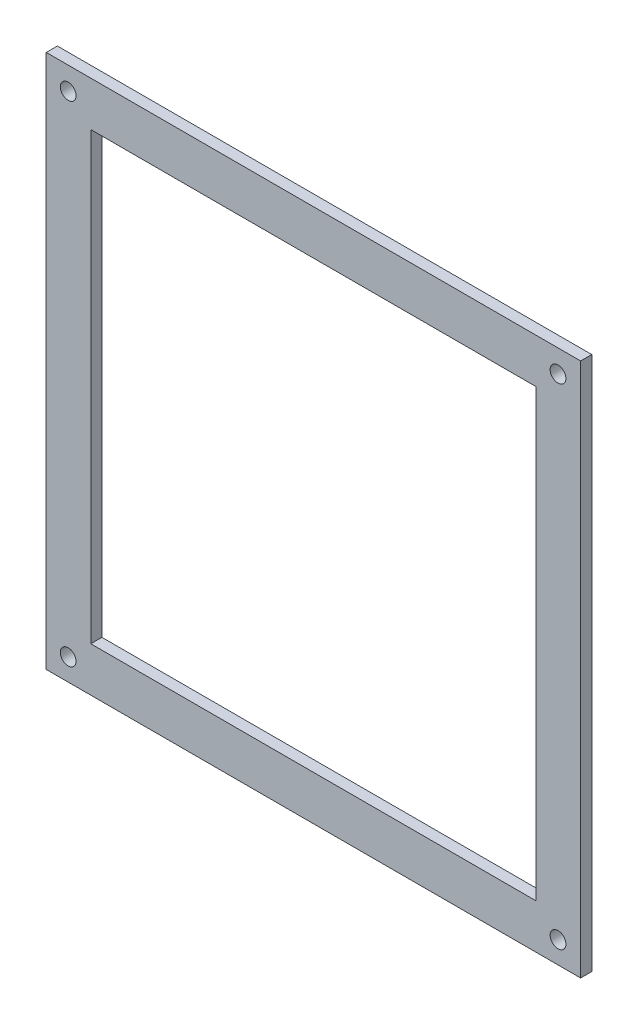
ISO-10303-21;
HEADER;
FILE_DESCRIPTION(('STEP AP214'),'2;1');
FILE_NAME('part.step','',(''),(''),'','','');
FILE_SCHEMA(('AUTOMOTIVE_DESIGN { 1 0 10303 214 1 1 1 1 }'));
ENDSEC;
DATA;
#1=APPLICATION_CONTEXT('core data for automotive mechanical design processes');
#2=APPLICATION_PROTOCOL_DEFINITION('international standard','automotive_design',2000,#1);
#3=PRODUCT_CONTEXT('',#1,'mechanical');
#4=PRODUCT('Part','Part','',(#3));
#5=PRODUCT_RELATED_PRODUCT_CATEGORY('part','',(#4));
#6=PRODUCT_DEFINITION_FORMATION('','',#4);
#7=PRODUCT_DEFINITION_CONTEXT('part definition',#1,'design');
#8=PRODUCT_DEFINITION('design','',#6,#7);
#9=PRODUCT_DEFINITION_SHAPE('','',#8);
#10=(LENGTH_UNIT() NAMED_UNIT(*) SI_UNIT(.MILLI.,.METRE.));
#11=(NAMED_UNIT(*) PLANE_ANGLE_UNIT() SI_UNIT($,.RADIAN.));
#12=(NAMED_UNIT(*) SI_UNIT($,.STERADIAN.) SOLID_ANGLE_UNIT());
#13=UNCERTAINTY_MEASURE_WITH_UNIT(LENGTH_MEASURE(1.E-05),#10,'distance_accuracy_value','');
#14=(GEOMETRIC_REPRESENTATION_CONTEXT(3) GLOBAL_UNCERTAINTY_ASSIGNED_CONTEXT((#13)) GLOBAL_UNIT_ASSIGNED_CONTEXT((#10,
#11,#12)) REPRESENTATION_CONTEXT('',''));
#15=CARTESIAN_POINT('',(0.,0.,0.));
#16=DIRECTION('',(0.,0.,1.));
#17=DIRECTION('',(1.,0.,0.));
#18=AXIS2_PLACEMENT_3D('',#15,#16,#17);
#19=CARTESIAN_POINT('',(0.,0.,3.175));
#20=DIRECTION('',(0.,0.,1.));
#21=DIRECTION('',(1.,0.,0.));
#22=AXIS2_PLACEMENT_3D('',#19,#20,#21);
#23=PLANE('',#22);
#24=CARTESIAN_POINT('',(108.083883370731,-105.426440860511,3.175));
#25=DIRECTION('',(0.,0.,1.));
#26=DIRECTION('',(1.,0.,0.));
#27=AXIS2_PLACEMENT_3D('',#24,#25,#26);
#28=CIRCLE('',#27,2.24789999999998);
#29=CARTESIAN_POINT('',(110.331783370731,-105.426440860511,3.175));
#30=VERTEX_POINT('',#29);
#31=EDGE_CURVE('E241',#30,#30,#28,.T.);
#32=ORIENTED_EDGE('',*,*,#31,.F.);
#33=EDGE_LOOP('',(#32));
#34=FACE_BOUND('',#33,.T.);
#35=CARTESIAN_POINT('',(108.083883370731,34.2735591394892,3.175));
#36=DIRECTION('',(0.,0.,1.));
#37=DIRECTION('',(1.,0.,0.));
#38=AXIS2_PLACEMENT_3D('',#35,#36,#37);
#39=CIRCLE('',#38,2.24789999999998);
#40=CARTESIAN_POINT('',(110.331783370731,34.2735591394892,3.175));
#41=VERTEX_POINT('',#40);
#42=EDGE_CURVE('E243',#41,#41,#39,.T.);
#43=ORIENTED_EDGE('',*,*,#42,.F.);
#44=EDGE_LOOP('',(#43));
#45=FACE_BOUND('',#44,.T.);
#46=CARTESIAN_POINT('',(-31.6161166292687,-105.426440860511,3.175));
#47=DIRECTION('',(0.,0.,1.));
#48=DIRECTION('',(1.,0.,0.));
#49=AXIS2_PLACEMENT_3D('',#46,#47,#48);
#50=CIRCLE('',#49,2.24789999999999);
#51=CARTESIAN_POINT('',(-29.3682166292687,-105.426440860511,3.175));
#52=VERTEX_POINT('',#51);
#53=EDGE_CURVE('E251',#52,#52,#50,.T.);
#54=ORIENTED_EDGE('',*,*,#53,.F.);
#55=EDGE_LOOP('',(#54));
#56=FACE_BOUND('',#55,.T.);
#57=CARTESIAN_POINT('',(-31.6161166292687,34.2735591394892,3.175));
#58=DIRECTION('',(0.,0.,1.));
#59=DIRECTION('',(1.,0.,0.));
#60=AXIS2_PLACEMENT_3D('',#57,#58,#59);
#61=CIRCLE('',#60,2.24789999999999);
#62=CARTESIAN_POINT('',(-29.3682166292687,34.2735591394892,3.175));
#63=VERTEX_POINT('',#62);
#64=EDGE_CURVE('E257',#63,#63,#61,.T.);
#65=ORIENTED_EDGE('',*,*,#64,.F.);
#66=EDGE_LOOP('',(#65));
#67=FACE_BOUND('',#66,.T.);
#68=DIRECTION('',(0.,-1.,0.));
#69=VECTOR('',#68,1.);
#70=CARTESIAN_POINT('',(-37.8687086092715,40.7283112582781,3.175));
#71=LINE('',#70,#69);
#72=CARTESIAN_POINT('',(-37.8687086092715,40.7283112582781,3.175));
#73=VERTEX_POINT('',#72);
#74=CARTESIAN_POINT('',(-37.8687086092715,-111.671688741722,3.175));
#75=VERTEX_POINT('',#74);
#76=EDGE_CURVE('E138',#73,#75,#71,.T.);
#77=ORIENTED_EDGE('',*,*,#76,.T.);
#78=DIRECTION('',(1.,0.,0.));
#79=VECTOR('',#78,1.);
#80=CARTESIAN_POINT('',(-37.8687086092715,-111.671688741722,3.175));
#81=LINE('',#80,#79);
#82=CARTESIAN_POINT('',(114.531291390728,-111.671688741722,3.175));
#83=VERTEX_POINT('',#82);
#84=EDGE_CURVE('E141',#75,#83,#81,.T.);
#85=ORIENTED_EDGE('',*,*,#84,.T.);
#86=DIRECTION('',(0.,1.,0.));
#87=VECTOR('',#86,1.);
#88=CARTESIAN_POINT('',(114.531291390728,40.7283112582781,3.175));
#89=LINE('',#88,#87);
#90=CARTESIAN_POINT('',(114.531291390728,40.7283112582781,3.175));
#91=VERTEX_POINT('',#90);
#92=EDGE_CURVE('E144',#83,#91,#89,.T.);
#93=ORIENTED_EDGE('',*,*,#92,.T.);
#94=DIRECTION('',(-1.,0.,0.));
#95=VECTOR('',#94,1.);
#96=CARTESIAN_POINT('',(-37.8687086092715,40.7283112582781,3.175));
#97=LINE('',#96,#95);
#98=EDGE_CURVE('E146',#91,#73,#97,.T.);
#99=ORIENTED_EDGE('',*,*,#98,.T.);
#100=EDGE_LOOP('',(#77,#85,#93,#99));
#101=FACE_BOUND('',#100,.T.);
#102=DIRECTION('',(1.,0.,0.));
#103=VECTOR('',#102,1.);
#104=CARTESIAN_POINT('',(-25.1687086092715,-98.9716887417219,3.175));
#105=LINE('',#104,#103);
#106=CARTESIAN_POINT('',(-25.1687086092715,-98.9716887417219,3.175));
#107=VERTEX_POINT('',#106);
#108=CARTESIAN_POINT('',(101.831291390728,-98.9716887417219,3.175));
#109=VERTEX_POINT('',#108);
#110=EDGE_CURVE('E108',#107,#109,#105,.T.);
#111=ORIENTED_EDGE('',*,*,#110,.F.);
#112=DIRECTION('',(0.,-1.,0.));
#113=VECTOR('',#112,1.);
#114=CARTESIAN_POINT('',(-25.1687086092715,28.0283112582781,3.175));
#115=LINE('',#114,#113);
#116=CARTESIAN_POINT('',(-25.1687086092715,28.0283112582781,3.175));
#117=VERTEX_POINT('',#116);
#118=EDGE_CURVE('E100',#117,#107,#115,.T.);
#119=ORIENTED_EDGE('',*,*,#118,.F.);
#120=DIRECTION('',(-1.,0.,0.));
#121=VECTOR('',#120,1.);
#122=CARTESIAN_POINT('',(-25.1687086092715,28.0283112582781,3.175));
#123=LINE('',#122,#121);
#124=CARTESIAN_POINT('',(101.831291390728,28.0283112582781,3.175));
#125=VERTEX_POINT('',#124);
#126=EDGE_CURVE('E122',#125,#117,#123,.T.);
#127=ORIENTED_EDGE('',*,*,#126,.F.);
#128=DIRECTION('',(0.,1.,0.));
#129=VECTOR('',#128,1.);
#130=CARTESIAN_POINT('',(101.831291390728,28.0283112582781,3.175));
#131=LINE('',#130,#129);
#132=EDGE_CURVE('E120',#109,#125,#131,.T.);
#133=ORIENTED_EDGE('',*,*,#132,.F.);
#134=EDGE_LOOP('',(#111,#119,#127,#133));
#135=FACE_BOUND('',#134,.T.);
#136=ADVANCED_FACE('F35',(#34,#45,#56,#67,#101,#135),#23,.T.);
#137=CARTESIAN_POINT('',(0.,0.,0.));
#138=DIRECTION('',(0.,0.,1.));
#139=DIRECTION('',(1.,0.,0.));
#140=AXIS2_PLACEMENT_3D('',#137,#138,#139);
#141=PLANE('',#140);
#142=CARTESIAN_POINT('',(108.083883370731,-105.426440860511,0.));
#143=DIRECTION('',(0.,0.,1.));
#144=DIRECTION('',(1.,0.,0.));
#145=AXIS2_PLACEMENT_3D('',#142,#143,#144);
#146=CIRCLE('',#145,2.24789999999998);
#147=CARTESIAN_POINT('',(110.331783370731,-105.426440860511,0.));
#148=VERTEX_POINT('',#147);
#149=EDGE_CURVE('E239',#148,#148,#146,.T.);
#150=ORIENTED_EDGE('',*,*,#149,.T.);
#151=EDGE_LOOP('',(#150));
#152=FACE_BOUND('',#151,.T.);
#153=CARTESIAN_POINT('',(108.083883370731,34.2735591394892,0.));
#154=DIRECTION('',(0.,0.,1.));
#155=DIRECTION('',(1.,0.,0.));
#156=AXIS2_PLACEMENT_3D('',#153,#154,#155);
#157=CIRCLE('',#156,2.24789999999998);
#158=CARTESIAN_POINT('',(110.331783370731,34.2735591394892,0.));
#159=VERTEX_POINT('',#158);
#160=EDGE_CURVE('E248',#159,#159,#157,.T.);
#161=ORIENTED_EDGE('',*,*,#160,.T.);
#162=EDGE_LOOP('',(#161));
#163=FACE_BOUND('',#162,.T.);
#164=CARTESIAN_POINT('',(-31.6161166292687,-105.426440860511,0.));
#165=DIRECTION('',(0.,0.,1.));
#166=DIRECTION('',(1.,0.,0.));
#167=AXIS2_PLACEMENT_3D('',#164,#165,#166);
#168=CIRCLE('',#167,2.24789999999998);
#169=CARTESIAN_POINT('',(-29.3682166292687,-105.426440860511,0.));
#170=VERTEX_POINT('',#169);
#171=EDGE_CURVE('E254',#170,#170,#168,.T.);
#172=ORIENTED_EDGE('',*,*,#171,.T.);
#173=EDGE_LOOP('',(#172));
#174=FACE_BOUND('',#173,.T.);
#175=CARTESIAN_POINT('',(-31.6161166292687,34.2735591394892,0.));
#176=DIRECTION('',(0.,0.,1.));
#177=DIRECTION('',(1.,0.,0.));
#178=AXIS2_PLACEMENT_3D('',#175,#176,#177);
#179=CIRCLE('',#178,2.24789999999998);
#180=CARTESIAN_POINT('',(-29.3682166292687,34.2735591394892,0.));
#181=VERTEX_POINT('',#180);
#182=EDGE_CURVE('E128',#181,#181,#179,.T.);
#183=ORIENTED_EDGE('',*,*,#182,.T.);
#184=EDGE_LOOP('',(#183));
#185=FACE_BOUND('',#184,.T.);
#186=DIRECTION('',(0.,-1.,0.));
#187=VECTOR('',#186,1.);
#188=CARTESIAN_POINT('',(-37.8687086092715,40.7283112582781,0.));
#189=LINE('',#188,#187);
#190=CARTESIAN_POINT('',(-37.8687086092715,40.7283112582781,0.));
#191=VERTEX_POINT('',#190);
#192=CARTESIAN_POINT('',(-37.8687086092715,-111.671688741722,0.));
#193=VERTEX_POINT('',#192);
#194=EDGE_CURVE('E116',#191,#193,#189,.T.);
#195=ORIENTED_EDGE('',*,*,#194,.F.);
#196=DIRECTION('',(-1.,0.,0.));
#197=VECTOR('',#196,1.);
#198=CARTESIAN_POINT('',(-37.8687086092715,40.7283112582781,0.));
#199=LINE('',#198,#197);
#200=CARTESIAN_POINT('',(114.531291390728,40.7283112582781,0.));
#201=VERTEX_POINT('',#200);
#202=EDGE_CURVE('E142',#201,#191,#199,.T.);
#203=ORIENTED_EDGE('',*,*,#202,.F.);
#204=DIRECTION('',(0.,1.,0.));
#205=VECTOR('',#204,1.);
#206=CARTESIAN_POINT('',(114.531291390728,40.7283112582781,0.));
#207=LINE('',#206,#205);
#208=CARTESIAN_POINT('',(114.531291390728,-111.671688741722,0.));
#209=VERTEX_POINT('',#208);
#210=EDGE_CURVE('E153',#209,#201,#207,.T.);
#211=ORIENTED_EDGE('',*,*,#210,.F.);
#212=DIRECTION('',(1.,0.,0.));
#213=VECTOR('',#212,1.);
#214=CARTESIAN_POINT('',(-37.8687086092715,-111.671688741722,0.));
#215=LINE('',#214,#213);
#216=EDGE_CURVE('E151',#193,#209,#215,.T.);
#217=ORIENTED_EDGE('',*,*,#216,.F.);
#218=EDGE_LOOP('',(#195,#203,#211,#217));
#219=FACE_BOUND('',#218,.T.);
#220=DIRECTION('',(0.,-1.,0.));
#221=VECTOR('',#220,1.);
#222=CARTESIAN_POINT('',(-25.1687086092715,28.0283112582781,0.));
#223=LINE('',#222,#221);
#224=CARTESIAN_POINT('',(-25.1687086092715,28.0283112582781,0.));
#225=VERTEX_POINT('',#224);
#226=CARTESIAN_POINT('',(-25.1687086092715,-98.9716887417219,0.));
#227=VERTEX_POINT('',#226);
#228=EDGE_CURVE('E58',#225,#227,#223,.T.);
#229=ORIENTED_EDGE('',*,*,#228,.T.);
#230=DIRECTION('',(1.,0.,0.));
#231=VECTOR('',#230,1.);
#232=CARTESIAN_POINT('',(-25.1687086092715,-98.9716887417219,0.));
#233=LINE('',#232,#231);
#234=CARTESIAN_POINT('',(101.831291390728,-98.9716887417219,0.));
#235=VERTEX_POINT('',#234);
#236=EDGE_CURVE('E115',#227,#235,#233,.T.);
#237=ORIENTED_EDGE('',*,*,#236,.T.);
#238=DIRECTION('',(0.,1.,0.));
#239=VECTOR('',#238,1.);
#240=CARTESIAN_POINT('',(101.831291390728,28.0283112582781,0.));
#241=LINE('',#240,#239);
#242=CARTESIAN_POINT('',(101.831291390728,28.0283112582781,0.));
#243=VERTEX_POINT('',#242);
#244=EDGE_CURVE('E130',#235,#243,#241,.T.);
#245=ORIENTED_EDGE('',*,*,#244,.T.);
#246=DIRECTION('',(-1.,0.,0.));
#247=VECTOR('',#246,1.);
#248=CARTESIAN_POINT('',(-25.1687086092715,28.0283112582781,0.));
#249=LINE('',#248,#247);
#250=EDGE_CURVE('E109',#243,#225,#249,.T.);
#251=ORIENTED_EDGE('',*,*,#250,.T.);
#252=EDGE_LOOP('',(#229,#237,#245,#251));
#253=FACE_BOUND('',#252,.T.);
#254=ADVANCED_FACE('F171',(#152,#163,#174,#185,#219,#253),#141,.F.);
#255=CARTESIAN_POINT('',(-37.8687086092715,40.7283112582781,3.175));
#256=DIRECTION('',(1.,0.,0.));
#257=DIRECTION('',(0.,1.,0.));
#258=AXIS2_PLACEMENT_3D('',#255,#256,#257);
#259=PLANE('',#258);
#260=ORIENTED_EDGE('',*,*,#194,.T.);
#261=DIRECTION('',(0.,0.,-1.));
#262=VECTOR('',#261,1.);
#263=CARTESIAN_POINT('',(-37.8687086092715,-111.671688741722,3.175));
#264=LINE('',#263,#262);
#265=EDGE_CURVE('E11',#75,#193,#264,.T.);
#266=ORIENTED_EDGE('',*,*,#265,.F.);
#267=ORIENTED_EDGE('',*,*,#76,.F.);
#268=DIRECTION('',(0.,0.,-1.));
#269=VECTOR('',#268,1.);
#270=CARTESIAN_POINT('',(-37.8687086092715,40.7283112582781,3.175));
#271=LINE('',#270,#269);
#272=EDGE_CURVE('E148',#73,#191,#271,.T.);
#273=ORIENTED_EDGE('',*,*,#272,.T.);
#274=EDGE_LOOP('',(#260,#266,#267,#273));
#275=FACE_BOUND('',#274,.T.);
#276=ADVANCED_FACE('F37',(#275),#259,.F.);
#277=CARTESIAN_POINT('',(-37.8687086092715,-111.671688741722,3.175));
#278=DIRECTION('',(0.,1.,0.));
#279=DIRECTION('',(0.,0.,1.));
#280=AXIS2_PLACEMENT_3D('',#277,#278,#279);
#281=PLANE('',#280);
#282=ORIENTED_EDGE('',*,*,#216,.T.);
#283=DIRECTION('',(0.,0.,-1.));
#284=VECTOR('',#283,1.);
#285=CARTESIAN_POINT('',(114.531291390728,-111.671688741722,3.175));
#286=LINE('',#285,#284);
#287=EDGE_CURVE('E43',#83,#209,#286,.T.);
#288=ORIENTED_EDGE('',*,*,#287,.F.);
#289=ORIENTED_EDGE('',*,*,#84,.F.);
#290=ORIENTED_EDGE('',*,*,#265,.T.);
#291=EDGE_LOOP('',(#282,#288,#289,#290));
#292=FACE_BOUND('',#291,.T.);
#293=ADVANCED_FACE('F181',(#292),#281,.F.);
#294=CARTESIAN_POINT('',(114.531291390728,40.7283112582781,3.175));
#295=DIRECTION('',(-1.,0.,0.));
#296=DIRECTION('',(0.,-1.,0.));
#297=AXIS2_PLACEMENT_3D('',#294,#295,#296);
#298=PLANE('',#297);
#299=ORIENTED_EDGE('',*,*,#210,.T.);
#300=DIRECTION('',(0.,0.,-1.));
#301=VECTOR('',#300,1.);
#302=CARTESIAN_POINT('',(114.531291390728,40.7283112582781,3.175));
#303=LINE('',#302,#301);
#304=EDGE_CURVE('E158',#91,#201,#303,.T.);
#305=ORIENTED_EDGE('',*,*,#304,.F.);
#306=ORIENTED_EDGE('',*,*,#92,.F.);
#307=ORIENTED_EDGE('',*,*,#287,.T.);
#308=EDGE_LOOP('',(#299,#305,#306,#307));
#309=FACE_BOUND('',#308,.T.);
#310=ADVANCED_FACE('F165',(#309),#298,.F.);
#311=CARTESIAN_POINT('',(-37.8687086092715,40.7283112582781,3.175));
#312=DIRECTION('',(0.,-1.,0.));
#313=DIRECTION('',(0.,0.,-1.));
#314=AXIS2_PLACEMENT_3D('',#311,#312,#313);
#315=PLANE('',#314);
#316=ORIENTED_EDGE('',*,*,#202,.T.);
#317=ORIENTED_EDGE('',*,*,#272,.F.);
#318=ORIENTED_EDGE('',*,*,#98,.F.);
#319=ORIENTED_EDGE('',*,*,#304,.T.);
#320=EDGE_LOOP('',(#316,#317,#318,#319));
#321=FACE_BOUND('',#320,.T.);
#322=ADVANCED_FACE('F175',(#321),#315,.F.);
#323=CARTESIAN_POINT('',(-25.1687086092715,28.0283112582781,3.175));
#324=DIRECTION('',(1.,0.,0.));
#325=DIRECTION('',(0.,1.,0.));
#326=AXIS2_PLACEMENT_3D('',#323,#324,#325);
#327=PLANE('',#326);
#328=ORIENTED_EDGE('',*,*,#228,.F.);
#329=DIRECTION('',(0.,0.,-1.));
#330=VECTOR('',#329,1.);
#331=CARTESIAN_POINT('',(-25.1687086092715,28.0283112582781,3.175));
#332=LINE('',#331,#330);
#333=EDGE_CURVE('E104',#117,#225,#332,.T.);
#334=ORIENTED_EDGE('',*,*,#333,.F.);
#335=ORIENTED_EDGE('',*,*,#118,.T.);
#336=DIRECTION('',(0.,0.,-1.));
#337=VECTOR('',#336,1.);
#338=CARTESIAN_POINT('',(-25.1687086092715,-98.9716887417219,3.175));
#339=LINE('',#338,#337);
#340=EDGE_CURVE('E103',#107,#227,#339,.T.);
#341=ORIENTED_EDGE('',*,*,#340,.T.);
#342=EDGE_LOOP('',(#328,#334,#335,#341));
#343=FACE_BOUND('',#342,.T.);
#344=ADVANCED_FACE('F102',(#343),#327,.T.);
#345=CARTESIAN_POINT('',(-25.1687086092715,-98.9716887417219,3.175));
#346=DIRECTION('',(0.,1.,0.));
#347=DIRECTION('',(0.,0.,1.));
#348=AXIS2_PLACEMENT_3D('',#345,#346,#347);
#349=PLANE('',#348);
#350=ORIENTED_EDGE('',*,*,#236,.F.);
#351=ORIENTED_EDGE('',*,*,#340,.F.);
#352=ORIENTED_EDGE('',*,*,#110,.T.);
#353=DIRECTION('',(0.,0.,-1.));
#354=VECTOR('',#353,1.);
#355=CARTESIAN_POINT('',(101.831291390728,-98.9716887417219,3.175));
#356=LINE('',#355,#354);
#357=EDGE_CURVE('E117',#109,#235,#356,.T.);
#358=ORIENTED_EDGE('',*,*,#357,.T.);
#359=EDGE_LOOP('',(#350,#351,#352,#358));
#360=FACE_BOUND('',#359,.T.);
#361=ADVANCED_FACE('F112',(#360),#349,.T.);
#362=CARTESIAN_POINT('',(101.831291390728,28.0283112582781,3.175));
#363=DIRECTION('',(-1.,0.,0.));
#364=DIRECTION('',(0.,-1.,0.));
#365=AXIS2_PLACEMENT_3D('',#362,#363,#364);
#366=PLANE('',#365);
#367=ORIENTED_EDGE('',*,*,#244,.F.);
#368=ORIENTED_EDGE('',*,*,#357,.F.);
#369=ORIENTED_EDGE('',*,*,#132,.T.);
#370=DIRECTION('',(0.,0.,-1.));
#371=VECTOR('',#370,1.);
#372=CARTESIAN_POINT('',(101.831291390728,28.0283112582781,3.175));
#373=LINE('',#372,#371);
#374=EDGE_CURVE('E50',#125,#243,#373,.T.);
#375=ORIENTED_EDGE('',*,*,#374,.T.);
#376=EDGE_LOOP('',(#367,#368,#369,#375));
#377=FACE_BOUND('',#376,.T.);
#378=ADVANCED_FACE('F209',(#377),#366,.T.);
#379=CARTESIAN_POINT('',(-25.1687086092715,28.0283112582781,3.175));
#380=DIRECTION('',(0.,-1.,0.));
#381=DIRECTION('',(0.,0.,-1.));
#382=AXIS2_PLACEMENT_3D('',#379,#380,#381);
#383=PLANE('',#382);
#384=ORIENTED_EDGE('',*,*,#250,.F.);
#385=ORIENTED_EDGE('',*,*,#374,.F.);
#386=ORIENTED_EDGE('',*,*,#126,.T.);
#387=ORIENTED_EDGE('',*,*,#333,.T.);
#388=EDGE_LOOP('',(#384,#385,#386,#387));
#389=FACE_BOUND('',#388,.T.);
#390=ADVANCED_FACE('F213',(#389),#383,.T.);
#391=CARTESIAN_POINT('',(-31.6161166292687,34.2735591394892,3.175));
#392=DIRECTION('',(0.,0.,1.));
#393=DIRECTION('',(1.,0.,0.));
#394=AXIS2_PLACEMENT_3D('',#391,#392,#393);
#395=CYLINDRICAL_SURFACE('',#394,2.24789999999998);
#396=ORIENTED_EDGE('',*,*,#182,.F.);
#397=EDGE_LOOP('',(#396));
#398=FACE_BOUND('',#397,.T.);
#399=ORIENTED_EDGE('',*,*,#64,.T.);
#400=EDGE_LOOP('',(#399));
#401=FACE_BOUND('',#400,.T.);
#402=ADVANCED_FACE('F219',(#398,#401),#395,.F.);
#403=CARTESIAN_POINT('',(-31.6161166292687,-105.426440860511,3.175));
#404=DIRECTION('',(0.,0.,1.));
#405=DIRECTION('',(1.,0.,0.));
#406=AXIS2_PLACEMENT_3D('',#403,#404,#405);
#407=CYLINDRICAL_SURFACE('',#406,2.24789999999998);
#408=ORIENTED_EDGE('',*,*,#171,.F.);
#409=EDGE_LOOP('',(#408));
#410=FACE_BOUND('',#409,.T.);
#411=ORIENTED_EDGE('',*,*,#53,.T.);
#412=EDGE_LOOP('',(#411));
#413=FACE_BOUND('',#412,.T.);
#414=ADVANCED_FACE('F222',(#410,#413),#407,.F.);
#415=CARTESIAN_POINT('',(108.083883370731,34.2735591394892,3.175));
#416=DIRECTION('',(0.,0.,1.));
#417=DIRECTION('',(1.,0.,0.));
#418=AXIS2_PLACEMENT_3D('',#415,#416,#417);
#419=CYLINDRICAL_SURFACE('',#418,2.24789999999998);
#420=ORIENTED_EDGE('',*,*,#160,.F.);
#421=EDGE_LOOP('',(#420));
#422=FACE_BOUND('',#421,.T.);
#423=ORIENTED_EDGE('',*,*,#42,.T.);
#424=EDGE_LOOP('',(#423));
#425=FACE_BOUND('',#424,.T.);
#426=ADVANCED_FACE('F226',(#422,#425),#419,.F.);
#427=CARTESIAN_POINT('',(108.083883370731,-105.426440860511,3.175));
#428=DIRECTION('',(0.,0.,1.));
#429=DIRECTION('',(1.,0.,0.));
#430=AXIS2_PLACEMENT_3D('',#427,#428,#429);
#431=CYLINDRICAL_SURFACE('',#430,2.24789999999998);
#432=ORIENTED_EDGE('',*,*,#149,.F.);
#433=EDGE_LOOP('',(#432));
#434=FACE_BOUND('',#433,.T.);
#435=ORIENTED_EDGE('',*,*,#31,.T.);
#436=EDGE_LOOP('',(#435));
#437=FACE_BOUND('',#436,.T.);
#438=ADVANCED_FACE('F230',(#434,#437),#431,.F.);
#439=CLOSED_SHELL('',(#136,#254,#276,#293,#310,#322,#344,#361,#378,#390,#402,#414,#426,#438));
#440=MANIFOLD_SOLID_BREP('B2',#439);
#441=ADVANCED_BREP_SHAPE_REPRESENTATION('',(#18,#440),#14);
#442=SHAPE_DEFINITION_REPRESENTATION(#9,#441);
ENDSEC;
END-ISO-10303-21;
